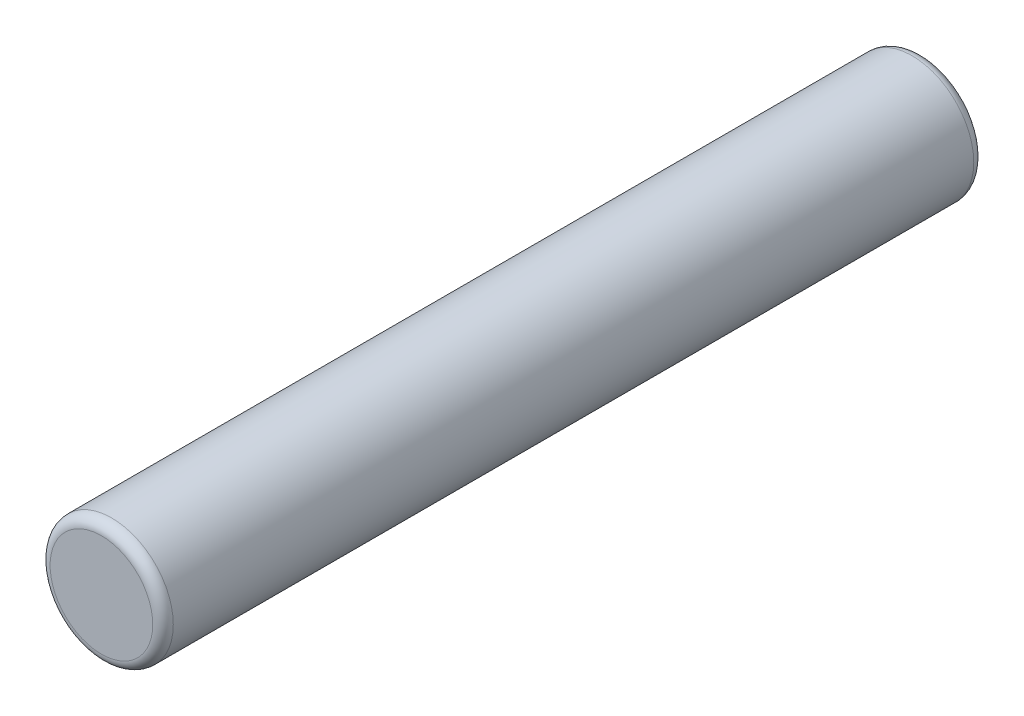
ISO-10303-21;
HEADER;
FILE_DESCRIPTION(('STEP AP214'),'2;1');
FILE_NAME('part.step','',(''),(''),'','','');
FILE_SCHEMA(('AUTOMOTIVE_DESIGN { 1 0 10303 214 1 1 1 1 }'));
ENDSEC;
DATA;
#1=APPLICATION_CONTEXT('core data for automotive mechanical design processes');
#2=APPLICATION_PROTOCOL_DEFINITION('international standard','automotive_design',2000,#1);
#3=PRODUCT_CONTEXT('',#1,'mechanical');
#4=PRODUCT('Part','Part','',(#3));
#5=PRODUCT_RELATED_PRODUCT_CATEGORY('part','',(#4));
#6=PRODUCT_DEFINITION_FORMATION('','',#4);
#7=PRODUCT_DEFINITION_CONTEXT('part definition',#1,'design');
#8=PRODUCT_DEFINITION('design','',#6,#7);
#9=PRODUCT_DEFINITION_SHAPE('','',#8);
#10=(LENGTH_UNIT() NAMED_UNIT(*) SI_UNIT(.MILLI.,.METRE.));
#11=(NAMED_UNIT(*) PLANE_ANGLE_UNIT() SI_UNIT($,.RADIAN.));
#12=(NAMED_UNIT(*) SI_UNIT($,.STERADIAN.) SOLID_ANGLE_UNIT());
#13=UNCERTAINTY_MEASURE_WITH_UNIT(LENGTH_MEASURE(1.E-05),#10,'distance_accuracy_value','');
#14=(GEOMETRIC_REPRESENTATION_CONTEXT(3) GLOBAL_UNCERTAINTY_ASSIGNED_CONTEXT((#13)) GLOBAL_UNIT_ASSIGNED_CONTEXT((#10,
#11,#12)) REPRESENTATION_CONTEXT('',''));
#15=CARTESIAN_POINT('',(0.,0.,0.));
#16=DIRECTION('',(0.,0.,1.));
#17=DIRECTION('',(1.,0.,0.));
#18=AXIS2_PLACEMENT_3D('',#15,#16,#17);
#19=CARTESIAN_POINT('',(0.,0.,80.));
#20=DIRECTION('',(0.,0.,-1.));
#21=DIRECTION('',(-1.,0.,0.));
#22=AXIS2_PLACEMENT_3D('',#19,#20,#21);
#23=CYLINDRICAL_SURFACE('',#22,6.);
#24=CARTESIAN_POINT('',(0.,0.,1.));
#25=DIRECTION('',(0.,0.,1.));
#26=DIRECTION('',(1.,0.,0.));
#27=AXIS2_PLACEMENT_3D('',#24,#25,#26);
#28=CIRCLE('',#27,6.);
#29=CARTESIAN_POINT('',(6.,0.,1.));
#30=VERTEX_POINT('',#29);
#31=EDGE_CURVE('E41',#30,#30,#28,.T.);
#32=ORIENTED_EDGE('',*,*,#31,.T.);
#33=EDGE_LOOP('',(#32));
#34=FACE_BOUND('',#33,.T.);
#35=CARTESIAN_POINT('',(0.,0.,79.));
#36=DIRECTION('',(0.,0.,1.));
#37=DIRECTION('',(1.,0.,0.));
#38=AXIS2_PLACEMENT_3D('',#35,#36,#37);
#39=CIRCLE('',#38,6.);
#40=CARTESIAN_POINT('',(6.,0.,79.));
#41=VERTEX_POINT('',#40);
#42=EDGE_CURVE('E45',#41,#41,#39,.F.);
#43=ORIENTED_EDGE('',*,*,#42,.T.);
#44=EDGE_LOOP('',(#43));
#45=FACE_BOUND('',#44,.T.);
#46=ADVANCED_FACE('F30',(#34,#45),#23,.T.);
#47=CARTESIAN_POINT('',(0.,0.,80.));
#48=DIRECTION('',(0.,0.,1.));
#49=DIRECTION('',(1.,0.,0.));
#50=AXIS2_PLACEMENT_3D('',#47,#48,#49);
#51=PLANE('',#50);
#52=CARTESIAN_POINT('',(0.,0.,80.));
#53=DIRECTION('',(0.,0.,1.));
#54=DIRECTION('',(1.,0.,0.));
#55=AXIS2_PLACEMENT_3D('',#52,#53,#54);
#56=CIRCLE('',#55,5.);
#57=CARTESIAN_POINT('',(5.,0.,80.));
#58=VERTEX_POINT('',#57);
#59=EDGE_CURVE('E10',#58,#58,#56,.T.);
#60=ORIENTED_EDGE('',*,*,#59,.T.);
#61=EDGE_LOOP('',(#60));
#62=FACE_BOUND('',#61,.T.);
#63=ADVANCED_FACE('F61',(#62),#51,.T.);
#64=CARTESIAN_POINT('',(0.,0.,0.));
#65=DIRECTION('',(0.,0.,1.));
#66=DIRECTION('',(1.,0.,0.));
#67=AXIS2_PLACEMENT_3D('',#64,#65,#66);
#68=PLANE('',#67);
#69=CARTESIAN_POINT('',(0.,0.,0.));
#70=DIRECTION('',(0.,0.,1.));
#71=DIRECTION('',(1.,0.,0.));
#72=AXIS2_PLACEMENT_3D('',#69,#70,#71);
#73=CIRCLE('',#72,5.);
#74=CARTESIAN_POINT('',(5.,0.,0.));
#75=VERTEX_POINT('',#74);
#76=EDGE_CURVE('E37',#75,#75,#73,.F.);
#77=ORIENTED_EDGE('',*,*,#76,.T.);
#78=EDGE_LOOP('',(#77));
#79=FACE_BOUND('',#78,.T.);
#80=ADVANCED_FACE('F58',(#79),#68,.F.);
#81=CARTESIAN_POINT('',(0.,0.,1.));
#82=DIRECTION('',(0.,0.,1.));
#83=DIRECTION('',(1.,0.,0.));
#84=AXIS2_PLACEMENT_3D('',#81,#82,#83);
#85=TOROIDAL_SURFACE('',#84,5.,1.);
#86=ORIENTED_EDGE('',*,*,#76,.F.);
#87=EDGE_LOOP('',(#86));
#88=FACE_BOUND('',#87,.T.);
#89=ORIENTED_EDGE('',*,*,#31,.F.);
#90=EDGE_LOOP('',(#89));
#91=FACE_BOUND('',#90,.T.);
#92=ADVANCED_FACE('F54',(#88,#91),#85,.T.);
#93=CARTESIAN_POINT('',(0.,0.,79.));
#94=DIRECTION('',(0.,0.,1.));
#95=DIRECTION('',(1.,0.,0.));
#96=AXIS2_PLACEMENT_3D('',#93,#94,#95);
#97=TOROIDAL_SURFACE('',#96,5.,1.);
#98=ORIENTED_EDGE('',*,*,#42,.F.);
#99=EDGE_LOOP('',(#98));
#100=FACE_BOUND('',#99,.T.);
#101=ORIENTED_EDGE('',*,*,#59,.F.);
#102=EDGE_LOOP('',(#101));
#103=FACE_BOUND('',#102,.T.);
#104=ADVANCED_FACE('F32',(#100,#103),#97,.T.);
#105=CLOSED_SHELL('',(#46,#63,#80,#92,#104));
#106=MANIFOLD_SOLID_BREP('B2',#105);
#107=ADVANCED_BREP_SHAPE_REPRESENTATION('',(#18,#106),#14);
#108=SHAPE_DEFINITION_REPRESENTATION(#9,#107);
ENDSEC;
END-ISO-10303-21;
